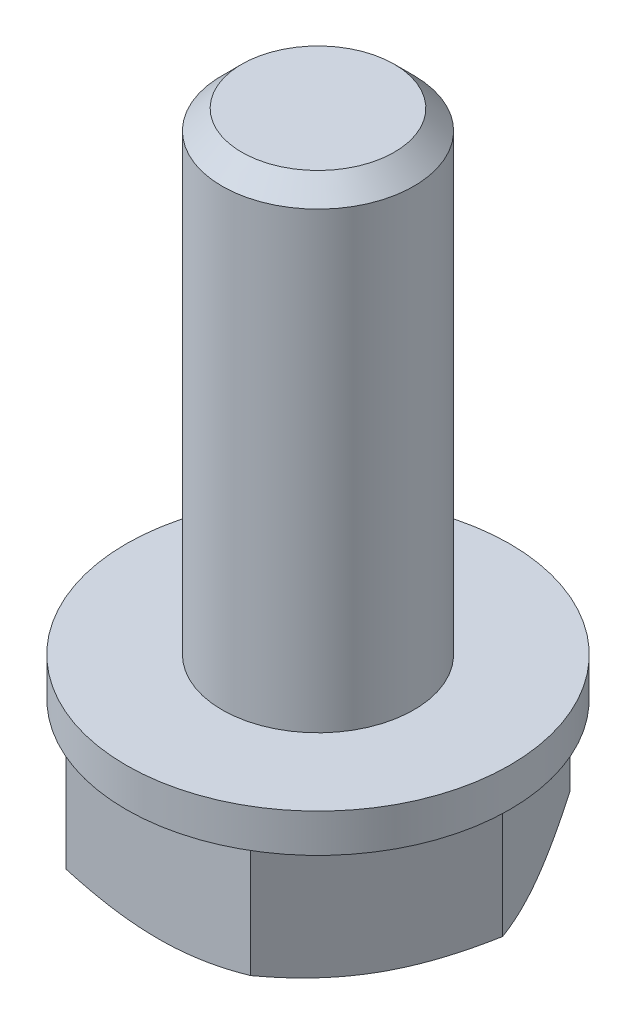
ISO-10303-21;
HEADER;
FILE_DESCRIPTION(('STEP AP214'),'2;1');
FILE_NAME('part.step','',(''),(''),'','','');
FILE_SCHEMA(('AUTOMOTIVE_DESIGN { 1 0 10303 214 1 1 1 1 }'));
ENDSEC;
DATA;
#1=APPLICATION_CONTEXT('core data for automotive mechanical design processes');
#2=APPLICATION_PROTOCOL_DEFINITION('international standard','automotive_design',2000,#1);
#3=PRODUCT_CONTEXT('',#1,'mechanical');
#4=PRODUCT('Part','Part','',(#3));
#5=PRODUCT_RELATED_PRODUCT_CATEGORY('part','',(#4));
#6=PRODUCT_DEFINITION_FORMATION('','',#4);
#7=PRODUCT_DEFINITION_CONTEXT('part definition',#1,'design');
#8=PRODUCT_DEFINITION('design','',#6,#7);
#9=PRODUCT_DEFINITION_SHAPE('','',#8);
#10=(LENGTH_UNIT() NAMED_UNIT(*) SI_UNIT(.MILLI.,.METRE.));
#11=(NAMED_UNIT(*) PLANE_ANGLE_UNIT() SI_UNIT($,.RADIAN.));
#12=(NAMED_UNIT(*) SI_UNIT($,.STERADIAN.) SOLID_ANGLE_UNIT());
#13=UNCERTAINTY_MEASURE_WITH_UNIT(LENGTH_MEASURE(1.E-05),#10,'distance_accuracy_value','');
#14=(GEOMETRIC_REPRESENTATION_CONTEXT(3) GLOBAL_UNCERTAINTY_ASSIGNED_CONTEXT((#13)) GLOBAL_UNIT_ASSIGNED_CONTEXT((#10,
#11,#12)) REPRESENTATION_CONTEXT('',''));
#15=CARTESIAN_POINT('',(0.,0.,0.));
#16=DIRECTION('',(0.,0.,1.));
#17=DIRECTION('',(1.,0.,0.));
#18=AXIS2_PLACEMENT_3D('',#15,#16,#17);
#19=CARTESIAN_POINT('',(17.677669529664,-54.8,-20.177669529664));
#20=DIRECTION('',(0.,-1.,0.));
#21=DIRECTION('',(0.,0.,-1.));
#22=AXIS2_PLACEMENT_3D('',#19,#20,#21);
#23=PLANE('',#22);
#24=CARTESIAN_POINT('',(17.677669529664,-54.8,-17.677669529664));
#25=DIRECTION('',(0.,-1.,0.));
#26=DIRECTION('',(0.,0.,-1.));
#27=AXIS2_PLACEMENT_3D('',#24,#25,#26);
#28=CIRCLE('',#27,5.);
#29=CARTESIAN_POINT('',(17.677669529664,-54.8,-22.677669529664));
#30=VERTEX_POINT('',#29);
#31=CARTESIAN_POINT('',(22.0077965485861,-54.8,-20.1776695296641));
#32=VERTEX_POINT('',#31);
#33=EDGE_CURVE('E102',#30,#32,#28,.T.);
#34=ORIENTED_EDGE('',*,*,#33,.T.);
#35=CARTESIAN_POINT('',(17.677669529664,-54.8,-17.677669529664));
#36=DIRECTION('',(0.,-1.,0.));
#37=DIRECTION('',(0.,0.,-1.));
#38=AXIS2_PLACEMENT_3D('',#35,#36,#37);
#39=CIRCLE('',#38,5.);
#40=CARTESIAN_POINT('',(22.0077965485861,-54.8,-15.1776695296639));
#41=VERTEX_POINT('',#40);
#42=EDGE_CURVE('E113',#32,#41,#39,.T.);
#43=ORIENTED_EDGE('',*,*,#42,.T.);
#44=CARTESIAN_POINT('',(17.677669529664,-54.8,-17.677669529664));
#45=DIRECTION('',(0.,-1.,0.));
#46=DIRECTION('',(0.,0.,-1.));
#47=AXIS2_PLACEMENT_3D('',#44,#45,#46);
#48=CIRCLE('',#47,5.);
#49=CARTESIAN_POINT('',(17.677669529664,-54.8,-12.677669529664));
#50=VERTEX_POINT('',#49);
#51=EDGE_CURVE('E211',#41,#50,#48,.T.);
#52=ORIENTED_EDGE('',*,*,#51,.T.);
#53=CARTESIAN_POINT('',(17.677669529664,-54.8,-17.677669529664));
#54=DIRECTION('',(0.,-1.,0.));
#55=DIRECTION('',(0.,0.,-1.));
#56=AXIS2_PLACEMENT_3D('',#53,#54,#55);
#57=CIRCLE('',#56,5.);
#58=CARTESIAN_POINT('',(13.3475425107418,-54.8,-15.1776695296639));
#59=VERTEX_POINT('',#58);
#60=EDGE_CURVE('E82',#50,#59,#57,.T.);
#61=ORIENTED_EDGE('',*,*,#60,.T.);
#62=CARTESIAN_POINT('',(17.677669529664,-54.8,-17.677669529664));
#63=DIRECTION('',(0.,-1.,0.));
#64=DIRECTION('',(0.,0.,-1.));
#65=AXIS2_PLACEMENT_3D('',#62,#63,#64);
#66=CIRCLE('',#65,5.);
#67=CARTESIAN_POINT('',(13.3475425107418,-54.8,-20.1776695296641));
#68=VERTEX_POINT('',#67);
#69=EDGE_CURVE('E117',#59,#68,#66,.T.);
#70=ORIENTED_EDGE('',*,*,#69,.T.);
#71=CARTESIAN_POINT('',(17.677669529664,-54.8,-17.677669529664));
#72=DIRECTION('',(0.,-1.,0.));
#73=DIRECTION('',(0.,0.,-1.));
#74=AXIS2_PLACEMENT_3D('',#71,#72,#73);
#75=CIRCLE('',#74,5.);
#76=EDGE_CURVE('E114',#68,#30,#75,.T.);
#77=ORIENTED_EDGE('',*,*,#76,.T.);
#78=EDGE_LOOP('',(#34,#43,#52,#61,#70,#77));
#79=FACE_BOUND('',#78,.T.);
#80=ADVANCED_FACE('F16',(#79),#23,.T.);
#81=CARTESIAN_POINT('',(17.677669529664,-51.9113248654052,-17.677669529664));
#82=DIRECTION('',(0.,1.,0.));
#83=DIRECTION('',(0.,0.,-1.));
#84=AXIS2_PLACEMENT_3D('',#81,#82,#83);
#85=CYLINDRICAL_SURFACE('',#84,6.);
#86=CARTESIAN_POINT('',(17.677669529664,-49.6,-17.677669529664));
#87=DIRECTION('',(0.,-1.,0.));
#88=DIRECTION('',(0.,0.,-1.));
#89=AXIS2_PLACEMENT_3D('',#86,#87,#88);
#90=CIRCLE('',#89,6.);
#91=CARTESIAN_POINT('',(17.677669529664,-49.6,-23.677669529664));
#92=VERTEX_POINT('',#91);
#93=EDGE_CURVE('E11',#92,#92,#90,.T.);
#94=ORIENTED_EDGE('',*,*,#93,.T.);
#95=EDGE_LOOP('',(#94));
#96=FACE_BOUND('',#95,.T.);
#97=CARTESIAN_POINT('',(17.677669529664,-50.8,-17.677669529664));
#98=DIRECTION('',(0.,1.,0.));
#99=DIRECTION('',(0.,0.,-1.));
#100=AXIS2_PLACEMENT_3D('',#97,#98,#99);
#101=CIRCLE('',#100,6.);
#102=CARTESIAN_POINT('',(17.677669529664,-50.8,-23.677669529664));
#103=VERTEX_POINT('',#102);
#104=EDGE_CURVE('E189',#103,#103,#101,.T.);
#105=ORIENTED_EDGE('',*,*,#104,.T.);
#106=EDGE_LOOP('',(#105));
#107=FACE_BOUND('',#106,.T.);
#108=ADVANCED_FACE('F269',(#96,#107),#85,.T.);
#109=CARTESIAN_POINT('',(17.677669529664,-49.6,-22.177669529664));
#110=DIRECTION('',(0.,1.,0.));
#111=DIRECTION('',(0.,0.,1.));
#112=AXIS2_PLACEMENT_3D('',#109,#110,#111);
#113=PLANE('',#112);
#114=CARTESIAN_POINT('',(17.677669529664,-49.6,-17.677669529664));
#115=DIRECTION('',(0.,-1.,0.));
#116=DIRECTION('',(0.,0.,-1.));
#117=AXIS2_PLACEMENT_3D('',#114,#115,#116);
#118=CIRCLE('',#117,3.);
#119=CARTESIAN_POINT('',(17.677669529664,-49.6,-20.677669529664));
#120=VERTEX_POINT('',#119);
#121=EDGE_CURVE('E26',#120,#120,#118,.T.);
#122=ORIENTED_EDGE('',*,*,#121,.T.);
#123=EDGE_LOOP('',(#122));
#124=FACE_BOUND('',#123,.T.);
#125=ORIENTED_EDGE('',*,*,#93,.F.);
#126=EDGE_LOOP('',(#125));
#127=FACE_BOUND('',#126,.T.);
#128=ADVANCED_FACE('F255',(#124,#127),#113,.T.);
#129=CARTESIAN_POINT('',(17.677669529664,-42.50675,-17.677669529664));
#130=DIRECTION('',(0.,1.,0.));
#131=DIRECTION('',(0.,0.,-1.));
#132=AXIS2_PLACEMENT_3D('',#129,#130,#131);
#133=CYLINDRICAL_SURFACE('',#132,3.);
#134=CARTESIAN_POINT('',(17.677669529664,-35.4135,-17.677669529664));
#135=DIRECTION('',(0.,-1.,0.));
#136=DIRECTION('',(0.,0.,-1.));
#137=AXIS2_PLACEMENT_3D('',#134,#135,#136);
#138=CIRCLE('',#137,3.);
#139=CARTESIAN_POINT('',(17.677669529664,-35.4135,-20.677669529664));
#140=VERTEX_POINT('',#139);
#141=EDGE_CURVE('E166',#140,#140,#138,.T.);
#142=ORIENTED_EDGE('',*,*,#141,.T.);
#143=EDGE_LOOP('',(#142));
#144=FACE_BOUND('',#143,.T.);
#145=ORIENTED_EDGE('',*,*,#121,.F.);
#146=EDGE_LOOP('',(#145));
#147=FACE_BOUND('',#146,.T.);
#148=ADVANCED_FACE('F18',(#144,#147),#133,.T.);
#149=CARTESIAN_POINT('',(17.677669529664,-35.10675,-17.677669529664));
#150=DIRECTION('',(0.,-1.,0.));
#151=DIRECTION('',(0.,0.,-1.));
#152=AXIS2_PLACEMENT_3D('',#149,#150,#151);
#153=CONICAL_SURFACE('',#152,2.69325,0.785398163397448);
#154=CARTESIAN_POINT('',(17.677669529664,-34.8,-17.677669529664));
#155=DIRECTION('',(0.,-1.,0.));
#156=DIRECTION('',(0.,0.,-1.));
#157=AXIS2_PLACEMENT_3D('',#154,#155,#156);
#158=CIRCLE('',#157,2.3865);
#159=CARTESIAN_POINT('',(17.677669529664,-34.8,-20.064169529664));
#160=VERTEX_POINT('',#159);
#161=EDGE_CURVE('E160',#160,#160,#158,.T.);
#162=ORIENTED_EDGE('',*,*,#161,.T.);
#163=EDGE_LOOP('',(#162));
#164=FACE_BOUND('',#163,.T.);
#165=ORIENTED_EDGE('',*,*,#141,.F.);
#166=EDGE_LOOP('',(#165));
#167=FACE_BOUND('',#166,.T.);
#168=ADVANCED_FACE('F259',(#164,#167),#153,.T.);
#169=CARTESIAN_POINT('',(17.677669529664,-34.8,-18.870919529664));
#170=DIRECTION('',(0.,1.,0.));
#171=DIRECTION('',(0.,0.,1.));
#172=AXIS2_PLACEMENT_3D('',#169,#170,#171);
#173=PLANE('',#172);
#174=ORIENTED_EDGE('',*,*,#161,.F.);
#175=EDGE_LOOP('',(#174));
#176=FACE_BOUND('',#175,.T.);
#177=ADVANCED_FACE('F266',(#176),#173,.T.);
#178=CARTESIAN_POINT('',(17.677669529664,-54.5113248654052,-17.677669529664));
#179=DIRECTION('',(0.,1.,0.));
#180=DIRECTION('',(0.,0.,-1.));
#181=AXIS2_PLACEMENT_3D('',#178,#179,#180);
#182=CONICAL_SURFACE('',#181,5.5,1.04719755119662);
#183=CARTESIAN_POINT('',(17.677669529664,-54.8,-12.677669529664));
#184=CARTESIAN_POINT('',(16.3379235675084,-54.8,-12.677669529664));
#185=CARTESIAN_POINT('',(14.7909181837159,-54.3534180126148,-12.677669529664));
#186=(BOUNDED_CURVE() B_SPLINE_CURVE(2,(#183,#184,#185),.UNSPECIFIED.,.F.,
.F.) B_SPLINE_CURVE_WITH_KNOTS((3,3),(3.37692975540509,6.36174641112158),
.UNSPECIFIED.) CURVE() GEOMETRIC_REPRESENTATION_ITEM() RATIONAL_B_SPLINE_CURVE((1.,
1.04314139574021,1.01001874935746)) REPRESENTATION_ITEM(''));
#187=CARTESIAN_POINT('',(14.7909181837159,-54.3534180126148,-12.677669529664));
#188=VERTEX_POINT('',#187);
#189=EDGE_CURVE('E133',#50,#188,#186,.T.);
#190=ORIENTED_EDGE('',*,*,#189,.T.);
#191=CARTESIAN_POINT('',(14.7909181837159,-54.3534180126148,-12.677669529664));
#192=CARTESIAN_POINT('',(14.0174154918196,-54.8,-14.0174154918196));
#193=CARTESIAN_POINT('',(13.3475425107418,-54.8,-15.1776695296639));
#194=(BOUNDED_CURVE() B_SPLINE_CURVE(2,(#191,#192,#193),.UNSPECIFIED.,.F.,
.F.) B_SPLINE_CURVE_WITH_KNOTS((3,3),(0.392113099688607,3.37692975540508),
.UNSPECIFIED.) CURVE() GEOMETRIC_REPRESENTATION_ITEM() RATIONAL_B_SPLINE_CURVE((1.01001874935746,
1.04314139574019,1.)) REPRESENTATION_ITEM(''));
#195=EDGE_CURVE('E190',#188,#59,#194,.T.);
#196=ORIENTED_EDGE('',*,*,#195,.T.);
#197=ORIENTED_EDGE('',*,*,#60,.F.);
#198=EDGE_LOOP('',(#190,#196,#197));
#199=FACE_BOUND('',#198,.T.);
#200=ADVANCED_FACE('F282',(#199),#182,.T.);
#201=CARTESIAN_POINT('',(17.677669529664,-54.5113248654052,-17.677669529664));
#202=DIRECTION('',(0.,1.,0.));
#203=DIRECTION('',(0.,0.,-1.));
#204=AXIS2_PLACEMENT_3D('',#201,#202,#203);
#205=CONICAL_SURFACE('',#204,5.5,1.04719755119662);
#206=CARTESIAN_POINT('',(22.0077965485861,-54.8,-15.1776695296639));
#207=CARTESIAN_POINT('',(21.3379235675084,-54.8000000000001,-14.0174154918196));
#208=CARTESIAN_POINT('',(20.5644208756121,-54.3534180126148,-12.677669529664));
#209=(BOUNDED_CURVE() B_SPLINE_CURVE(2,(#206,#207,#208),.UNSPECIFIED.,.F.,
.F.) B_SPLINE_CURVE_WITH_KNOTS((3,3),(3.37692975540508,6.36174641112157),
.UNSPECIFIED.) CURVE() GEOMETRIC_REPRESENTATION_ITEM() RATIONAL_B_SPLINE_CURVE((1.,
1.0431413957402,1.01001874935746)) REPRESENTATION_ITEM(''));
#210=CARTESIAN_POINT('',(20.5644208756121,-54.3534180126148,-12.677669529664));
#211=VERTEX_POINT('',#210);
#212=EDGE_CURVE('E142',#41,#211,#209,.T.);
#213=ORIENTED_EDGE('',*,*,#212,.T.);
#214=CARTESIAN_POINT('',(20.5644208756121,-54.3534180126148,-12.677669529664));
#215=CARTESIAN_POINT('',(19.0174154918196,-54.8,-12.677669529664));
#216=CARTESIAN_POINT('',(17.677669529664,-54.8,-12.677669529664));
#217=(BOUNDED_CURVE() B_SPLINE_CURVE(2,(#214,#215,#216),.UNSPECIFIED.,.F.,
.F.) B_SPLINE_CURVE_WITH_KNOTS((3,3),(0.392113099688602,3.37692975540509),
.UNSPECIFIED.) CURVE() GEOMETRIC_REPRESENTATION_ITEM() RATIONAL_B_SPLINE_CURVE((1.01001874935746,
1.04314139574021,1.)) REPRESENTATION_ITEM(''));
#218=EDGE_CURVE('E174',#211,#50,#217,.T.);
#219=ORIENTED_EDGE('',*,*,#218,.T.);
#220=ORIENTED_EDGE('',*,*,#51,.F.);
#221=EDGE_LOOP('',(#213,#219,#220));
#222=FACE_BOUND('',#221,.T.);
#223=ADVANCED_FACE('F286',(#222),#205,.T.);
#224=CARTESIAN_POINT('',(17.677669529664,-54.5113248654052,-17.677669529664));
#225=DIRECTION('',(0.,1.,0.));
#226=DIRECTION('',(0.,0.,-1.));
#227=AXIS2_PLACEMENT_3D('',#224,#225,#226);
#228=CONICAL_SURFACE('',#227,5.5,1.04719755119662);
#229=CARTESIAN_POINT('',(22.0077965485861,-54.8,-20.1776695296641));
#230=CARTESIAN_POINT('',(22.677669529664,-54.8,-19.0174154918197));
#231=CARTESIAN_POINT('',(23.4511722215603,-54.3534180126148,-17.677669529664));
#232=(BOUNDED_CURVE() B_SPLINE_CURVE(2,(#229,#230,#231),.UNSPECIFIED.,.F.,
.F.) B_SPLINE_CURVE_WITH_KNOTS((3,3),(3.37692975540508,6.36174641112167),
.UNSPECIFIED.) CURVE() GEOMETRIC_REPRESENTATION_ITEM() RATIONAL_B_SPLINE_CURVE((1.,
1.04314139574019,1.01001874935746)) REPRESENTATION_ITEM(''));
#233=CARTESIAN_POINT('',(23.4511722215603,-54.3534180126148,-17.677669529664));
#234=VERTEX_POINT('',#233);
#235=EDGE_CURVE('E173',#32,#234,#232,.T.);
#236=ORIENTED_EDGE('',*,*,#235,.T.);
#237=CARTESIAN_POINT('',(23.4511722215603,-54.3534180126148,-17.677669529664));
#238=CARTESIAN_POINT('',(22.677669529664,-54.8,-16.3379235675083));
#239=CARTESIAN_POINT('',(22.0077965485861,-54.8,-15.1776695296639));
#240=(BOUNDED_CURVE() B_SPLINE_CURVE(2,(#237,#238,#239),.UNSPECIFIED.,.F.,
.F.) B_SPLINE_CURVE_WITH_KNOTS((3,3),(0.392113099688502,3.37692975540508),
.UNSPECIFIED.) CURVE() GEOMETRIC_REPRESENTATION_ITEM() RATIONAL_B_SPLINE_CURVE((1.01001874935746,
1.04314139574019,1.)) REPRESENTATION_ITEM(''));
#241=EDGE_CURVE('E167',#234,#41,#240,.T.);
#242=ORIENTED_EDGE('',*,*,#241,.T.);
#243=ORIENTED_EDGE('',*,*,#42,.F.);
#244=EDGE_LOOP('',(#236,#242,#243));
#245=FACE_BOUND('',#244,.T.);
#246=ADVANCED_FACE('F288',(#245),#228,.T.);
#247=CARTESIAN_POINT('',(17.677669529664,-54.5113248654052,-17.677669529664));
#248=DIRECTION('',(0.,1.,0.));
#249=DIRECTION('',(0.,0.,-1.));
#250=AXIS2_PLACEMENT_3D('',#247,#248,#249);
#251=CONICAL_SURFACE('',#250,5.5,1.04719755119662);
#252=CARTESIAN_POINT('',(20.5644208756121,-54.3534180126148,-22.677669529664));
#253=CARTESIAN_POINT('',(21.3379235675084,-54.8,-21.3379235675084));
#254=CARTESIAN_POINT('',(22.0077965485861,-54.8,-20.1776695296641));
#255=(BOUNDED_CURVE() B_SPLINE_CURVE(2,(#252,#253,#254),.UNSPECIFIED.,.F.,
.F.) B_SPLINE_CURVE_WITH_KNOTS((3,3),(0.392113099688607,3.37692975540508),
.UNSPECIFIED.) CURVE() GEOMETRIC_REPRESENTATION_ITEM() RATIONAL_B_SPLINE_CURVE((1.01001874935746,
1.04314139574019,1.)) REPRESENTATION_ITEM(''));
#256=CARTESIAN_POINT('',(20.5644208756121,-54.3534180126148,-22.677669529664));
#257=VERTEX_POINT('',#256);
#258=EDGE_CURVE('E110',#257,#32,#255,.T.);
#259=ORIENTED_EDGE('',*,*,#258,.T.);
#260=ORIENTED_EDGE('',*,*,#33,.F.);
#261=CARTESIAN_POINT('',(17.677669529664,-54.8,-22.677669529664));
#262=CARTESIAN_POINT('',(19.0174154918196,-54.8,-22.677669529664));
#263=CARTESIAN_POINT('',(20.5644208756121,-54.3534180126148,-22.677669529664));
#264=(BOUNDED_CURVE() B_SPLINE_CURVE(2,(#261,#262,#263),.UNSPECIFIED.,.F.,
.F.) B_SPLINE_CURVE_WITH_KNOTS((3,3),(3.37692975540509,6.36174641112158),
.UNSPECIFIED.) CURVE() GEOMETRIC_REPRESENTATION_ITEM() RATIONAL_B_SPLINE_CURVE((1.,
1.04314139574021,1.01001874935746)) REPRESENTATION_ITEM(''));
#265=EDGE_CURVE('E107',#30,#257,#264,.T.);
#266=ORIENTED_EDGE('',*,*,#265,.T.);
#267=EDGE_LOOP('',(#259,#260,#266));
#268=FACE_BOUND('',#267,.T.);
#269=ADVANCED_FACE('F104',(#268),#251,.T.);
#270=CARTESIAN_POINT('',(17.677669529664,-54.5113248654052,-17.677669529664));
#271=DIRECTION('',(0.,1.,0.));
#272=DIRECTION('',(0.,0.,-1.));
#273=AXIS2_PLACEMENT_3D('',#270,#271,#272);
#274=CONICAL_SURFACE('',#273,5.5,1.04719755119662);
#275=CARTESIAN_POINT('',(14.7909181837159,-54.3534180126148,-22.677669529664));
#276=CARTESIAN_POINT('',(16.3379235675084,-54.8,-22.677669529664));
#277=CARTESIAN_POINT('',(17.677669529664,-54.8,-22.677669529664));
#278=(BOUNDED_CURVE() B_SPLINE_CURVE(2,(#275,#276,#277),.UNSPECIFIED.,.F.,
.F.) B_SPLINE_CURVE_WITH_KNOTS((3,3),(0.392113099688602,3.37692975540509),
.UNSPECIFIED.) CURVE() GEOMETRIC_REPRESENTATION_ITEM() RATIONAL_B_SPLINE_CURVE((1.01001874935746,
1.04314139574021,1.)) REPRESENTATION_ITEM(''));
#279=CARTESIAN_POINT('',(14.7909181837159,-54.3534180126148,-22.677669529664));
#280=VERTEX_POINT('',#279);
#281=EDGE_CURVE('E122',#280,#30,#278,.T.);
#282=ORIENTED_EDGE('',*,*,#281,.T.);
#283=ORIENTED_EDGE('',*,*,#76,.F.);
#284=CARTESIAN_POINT('',(13.3475425107418,-54.8,-20.1776695296641));
#285=CARTESIAN_POINT('',(14.0174154918197,-54.8000000000001,-21.3379235675084));
#286=CARTESIAN_POINT('',(14.7909181837159,-54.3534180126148,-22.677669529664));
#287=(BOUNDED_CURVE() B_SPLINE_CURVE(2,(#284,#285,#286),.UNSPECIFIED.,.F.,
.F.) B_SPLINE_CURVE_WITH_KNOTS((3,3),(3.37692975540508,6.36174641112157),
.UNSPECIFIED.) CURVE() GEOMETRIC_REPRESENTATION_ITEM() RATIONAL_B_SPLINE_CURVE((1.,
1.0431413957402,1.01001874935746)) REPRESENTATION_ITEM(''));
#288=EDGE_CURVE('E125',#68,#280,#287,.T.);
#289=ORIENTED_EDGE('',*,*,#288,.T.);
#290=EDGE_LOOP('',(#282,#283,#289));
#291=FACE_BOUND('',#290,.T.);
#292=ADVANCED_FACE('F123',(#291),#274,.T.);
#293=CARTESIAN_POINT('',(17.677669529664,-54.5113248654052,-17.677669529664));
#294=DIRECTION('',(0.,1.,0.));
#295=DIRECTION('',(0.,0.,-1.));
#296=AXIS2_PLACEMENT_3D('',#293,#294,#295);
#297=CONICAL_SURFACE('',#296,5.5,1.04719755119662);
#298=CARTESIAN_POINT('',(11.9041668377677,-54.3534180126148,-17.677669529664));
#299=CARTESIAN_POINT('',(12.677669529664,-54.8,-19.0174154918197));
#300=CARTESIAN_POINT('',(13.3475425107418,-54.8,-20.1776695296641));
#301=(BOUNDED_CURVE() B_SPLINE_CURVE(2,(#298,#299,#300),.UNSPECIFIED.,.F.,
.F.) B_SPLINE_CURVE_WITH_KNOTS((3,3),(0.392113099688502,3.37692975540508),
.UNSPECIFIED.) CURVE() GEOMETRIC_REPRESENTATION_ITEM() RATIONAL_B_SPLINE_CURVE((1.01001874935746,
1.04314139574019,1.)) REPRESENTATION_ITEM(''));
#302=CARTESIAN_POINT('',(11.9041668377677,-54.3534180126148,-17.677669529664));
#303=VERTEX_POINT('',#302);
#304=EDGE_CURVE('E152',#303,#68,#301,.T.);
#305=ORIENTED_EDGE('',*,*,#304,.T.);
#306=ORIENTED_EDGE('',*,*,#69,.F.);
#307=CARTESIAN_POINT('',(13.3475425107418,-54.8,-15.1776695296639));
#308=CARTESIAN_POINT('',(12.677669529664,-54.8,-16.3379235675084));
#309=CARTESIAN_POINT('',(11.9041668377677,-54.3534180126148,-17.677669529664));
#310=(BOUNDED_CURVE() B_SPLINE_CURVE(2,(#307,#308,#309),.UNSPECIFIED.,.F.,
.F.) B_SPLINE_CURVE_WITH_KNOTS((3,3),(3.37692975540508,6.36174641112167),
.UNSPECIFIED.) CURVE() GEOMETRIC_REPRESENTATION_ITEM() RATIONAL_B_SPLINE_CURVE((1.,
1.04314139574019,1.01001874935746)) REPRESENTATION_ITEM(''));
#311=EDGE_CURVE('E188',#59,#303,#310,.T.);
#312=ORIENTED_EDGE('',*,*,#311,.T.);
#313=EDGE_LOOP('',(#305,#306,#312));
#314=FACE_BOUND('',#313,.T.);
#315=ADVANCED_FACE('F331',(#314),#297,.T.);
#316=CARTESIAN_POINT('',(17.677669529664,-50.8,-17.677669529664));
#317=DIRECTION('',(0.,-1.,0.));
#318=DIRECTION('',(-1.,0.,0.));
#319=AXIS2_PLACEMENT_3D('',#316,#317,#318);
#320=PLANE('',#319);
#321=DIRECTION('',(0.500000000000009,0.,-0.866025403784433));
#322=VECTOR('',#321,1.);
#323=CARTESIAN_POINT('',(23.4511722215603,-50.8,-17.677669529664));
#324=LINE('',#323,#322);
#325=CARTESIAN_POINT('',(20.5644208756121,-50.8,-12.677669529664));
#326=VERTEX_POINT('',#325);
#327=CARTESIAN_POINT('',(23.4511722215603,-50.8,-17.677669529664));
#328=VERTEX_POINT('',#327);
#329=EDGE_CURVE('E172',#326,#328,#324,.T.);
#330=ORIENTED_EDGE('',*,*,#329,.T.);
#331=DIRECTION('',(-0.500000000000009,0.,-0.866025403784433));
#332=VECTOR('',#331,1.);
#333=CARTESIAN_POINT('',(20.5644208756121,-50.8,-22.677669529664));
#334=LINE('',#333,#332);
#335=CARTESIAN_POINT('',(20.5644208756121,-50.8,-22.677669529664));
#336=VERTEX_POINT('',#335);
#337=EDGE_CURVE('E196',#328,#336,#334,.T.);
#338=ORIENTED_EDGE('',*,*,#337,.T.);
#339=DIRECTION('',(-1.,0.,0.));
#340=VECTOR('',#339,1.);
#341=CARTESIAN_POINT('',(14.7909181837159,-50.8,-22.677669529664));
#342=LINE('',#341,#340);
#343=CARTESIAN_POINT('',(14.7909181837159,-50.8,-22.677669529664));
#344=VERTEX_POINT('',#343);
#345=EDGE_CURVE('E192',#336,#344,#342,.T.);
#346=ORIENTED_EDGE('',*,*,#345,.T.);
#347=DIRECTION('',(-0.500000000000009,0.,0.866025403784433));
#348=VECTOR('',#347,1.);
#349=CARTESIAN_POINT('',(11.9041668377677,-50.8,-17.677669529664));
#350=LINE('',#349,#348);
#351=CARTESIAN_POINT('',(11.9041668377677,-50.8,-17.677669529664));
#352=VERTEX_POINT('',#351);
#353=EDGE_CURVE('E183',#344,#352,#350,.T.);
#354=ORIENTED_EDGE('',*,*,#353,.T.);
#355=DIRECTION('',(0.500000000000009,0.,0.866025403784433));
#356=VECTOR('',#355,1.);
#357=CARTESIAN_POINT('',(14.7909181837159,-50.8,-12.677669529664));
#358=LINE('',#357,#356);
#359=CARTESIAN_POINT('',(14.7909181837159,-50.8,-12.677669529664));
#360=VERTEX_POINT('',#359);
#361=EDGE_CURVE('E74',#352,#360,#358,.T.);
#362=ORIENTED_EDGE('',*,*,#361,.T.);
#363=DIRECTION('',(1.,0.,0.));
#364=VECTOR('',#363,1.);
#365=CARTESIAN_POINT('',(20.5644208756121,-50.8,-12.677669529664));
#366=LINE('',#365,#364);
#367=EDGE_CURVE('E182',#360,#326,#366,.T.);
#368=ORIENTED_EDGE('',*,*,#367,.T.);
#369=EDGE_LOOP('',(#330,#338,#346,#354,#362,#368));
#370=FACE_BOUND('',#369,.T.);
#371=ORIENTED_EDGE('',*,*,#104,.F.);
#372=EDGE_LOOP('',(#371));
#373=FACE_BOUND('',#372,.T.);
#374=ADVANCED_FACE('F309',(#370,#373),#320,.T.);
#375=CARTESIAN_POINT('',(11.9041668377677,-54.8,-17.677669529664));
#376=DIRECTION('',(0.866025403784433,0.,-0.500000000000009));
#377=DIRECTION('',(-0.500000000000009,0.,-0.866025403784433));
#378=AXIS2_PLACEMENT_3D('',#375,#376,#377);
#379=PLANE('',#378);
#380=ORIENTED_EDGE('',*,*,#311,.F.);
#381=ORIENTED_EDGE('',*,*,#195,.F.);
#382=DIRECTION('',(0.,1.,0.));
#383=VECTOR('',#382,1.);
#384=CARTESIAN_POINT('',(14.7909181837159,-54.8,-12.677669529664));
#385=LINE('',#384,#383);
#386=EDGE_CURVE('E136',#188,#360,#385,.T.);
#387=ORIENTED_EDGE('',*,*,#386,.T.);
#388=ORIENTED_EDGE('',*,*,#361,.F.);
#389=DIRECTION('',(0.,1.,0.));
#390=VECTOR('',#389,1.);
#391=CARTESIAN_POINT('',(11.9041668377677,-54.8,-17.677669529664));
#392=LINE('',#391,#390);
#393=EDGE_CURVE('E159',#303,#352,#392,.T.);
#394=ORIENTED_EDGE('',*,*,#393,.F.);
#395=EDGE_LOOP('',(#380,#381,#387,#388,#394));
#396=FACE_BOUND('',#395,.T.);
#397=ADVANCED_FACE('F217',(#396),#379,.F.);
#398=CARTESIAN_POINT('',(14.7909181837159,-54.8,-22.677669529664));
#399=DIRECTION('',(0.866025403784433,0.,0.500000000000009));
#400=DIRECTION('',(0.500000000000009,0.,-0.866025403784433));
#401=AXIS2_PLACEMENT_3D('',#398,#399,#400);
#402=PLANE('',#401);
#403=ORIENTED_EDGE('',*,*,#288,.F.);
#404=ORIENTED_EDGE('',*,*,#304,.F.);
#405=ORIENTED_EDGE('',*,*,#393,.T.);
#406=ORIENTED_EDGE('',*,*,#353,.F.);
#407=DIRECTION('',(0.,1.,0.));
#408=VECTOR('',#407,1.);
#409=CARTESIAN_POINT('',(14.7909181837159,-54.8,-22.677669529664));
#410=LINE('',#409,#408);
#411=EDGE_CURVE('E20',#280,#344,#410,.T.);
#412=ORIENTED_EDGE('',*,*,#411,.F.);
#413=EDGE_LOOP('',(#403,#404,#405,#406,#412));
#414=FACE_BOUND('',#413,.T.);
#415=ADVANCED_FACE('F215',(#414),#402,.F.);
#416=CARTESIAN_POINT('',(20.5644208756121,-54.8,-22.677669529664));
#417=DIRECTION('',(0.,0.,1.));
#418=DIRECTION('',(1.,0.,0.));
#419=AXIS2_PLACEMENT_3D('',#416,#417,#418);
#420=PLANE('',#419);
#421=ORIENTED_EDGE('',*,*,#265,.F.);
#422=ORIENTED_EDGE('',*,*,#281,.F.);
#423=ORIENTED_EDGE('',*,*,#411,.T.);
#424=ORIENTED_EDGE('',*,*,#345,.F.);
#425=DIRECTION('',(0.,1.,0.));
#426=VECTOR('',#425,1.);
#427=CARTESIAN_POINT('',(20.5644208756121,-54.8,-22.677669529664));
#428=LINE('',#427,#426);
#429=EDGE_CURVE('E132',#257,#336,#428,.T.);
#430=ORIENTED_EDGE('',*,*,#429,.F.);
#431=EDGE_LOOP('',(#421,#422,#423,#424,#430));
#432=FACE_BOUND('',#431,.T.);
#433=ADVANCED_FACE('F130',(#432),#420,.F.);
#434=CARTESIAN_POINT('',(14.7909181837159,-54.8,-12.677669529664));
#435=DIRECTION('',(0.,0.,-1.));
#436=DIRECTION('',(-1.,0.,0.));
#437=AXIS2_PLACEMENT_3D('',#434,#435,#436);
#438=PLANE('',#437);
#439=ORIENTED_EDGE('',*,*,#218,.F.);
#440=DIRECTION('',(0.,1.,0.));
#441=VECTOR('',#440,1.);
#442=CARTESIAN_POINT('',(20.5644208756121,-54.8,-12.677669529664));
#443=LINE('',#442,#441);
#444=EDGE_CURVE('E231',#211,#326,#443,.T.);
#445=ORIENTED_EDGE('',*,*,#444,.T.);
#446=ORIENTED_EDGE('',*,*,#367,.F.);
#447=ORIENTED_EDGE('',*,*,#386,.F.);
#448=ORIENTED_EDGE('',*,*,#189,.F.);
#449=EDGE_LOOP('',(#439,#445,#446,#447,#448));
#450=FACE_BOUND('',#449,.T.);
#451=ADVANCED_FACE('F285',(#450),#438,.F.);
#452=CARTESIAN_POINT('',(20.5644208756121,-54.8,-12.677669529664));
#453=DIRECTION('',(-0.866025403784433,0.,-0.500000000000009));
#454=DIRECTION('',(-0.500000000000009,0.,0.866025403784433));
#455=AXIS2_PLACEMENT_3D('',#452,#453,#454);
#456=PLANE('',#455);
#457=ORIENTED_EDGE('',*,*,#241,.F.);
#458=DIRECTION('',(0.,1.,0.));
#459=VECTOR('',#458,1.);
#460=CARTESIAN_POINT('',(23.4511722215603,-54.8,-17.677669529664));
#461=LINE('',#460,#459);
#462=EDGE_CURVE('E199',#234,#328,#461,.T.);
#463=ORIENTED_EDGE('',*,*,#462,.T.);
#464=ORIENTED_EDGE('',*,*,#329,.F.);
#465=ORIENTED_EDGE('',*,*,#444,.F.);
#466=ORIENTED_EDGE('',*,*,#212,.F.);
#467=EDGE_LOOP('',(#457,#463,#464,#465,#466));
#468=FACE_BOUND('',#467,.T.);
#469=ADVANCED_FACE('F303',(#468),#456,.F.);
#470=CARTESIAN_POINT('',(23.4511722215603,-54.8,-17.677669529664));
#471=DIRECTION('',(-0.866025403784433,0.,0.500000000000009));
#472=DIRECTION('',(0.500000000000009,0.,0.866025403784433));
#473=AXIS2_PLACEMENT_3D('',#470,#471,#472);
#474=PLANE('',#473);
#475=ORIENTED_EDGE('',*,*,#258,.F.);
#476=ORIENTED_EDGE('',*,*,#429,.T.);
#477=ORIENTED_EDGE('',*,*,#337,.F.);
#478=ORIENTED_EDGE('',*,*,#462,.F.);
#479=ORIENTED_EDGE('',*,*,#235,.F.);
#480=EDGE_LOOP('',(#475,#476,#477,#478,#479));
#481=FACE_BOUND('',#480,.T.);
#482=ADVANCED_FACE('F321',(#481),#474,.F.);
#483=CLOSED_SHELL('',(#80,#108,#128,#148,#168,#177,#200,#223,#246,#269,#292,#315,#374,#397,#415,
#433,#451,#469,#482));
#484=MANIFOLD_SOLID_BREP('B1',#483);
#485=ADVANCED_BREP_SHAPE_REPRESENTATION('',(#18,#484),#14);
#486=SHAPE_DEFINITION_REPRESENTATION(#9,#485);
ENDSEC;
END-ISO-10303-21;
